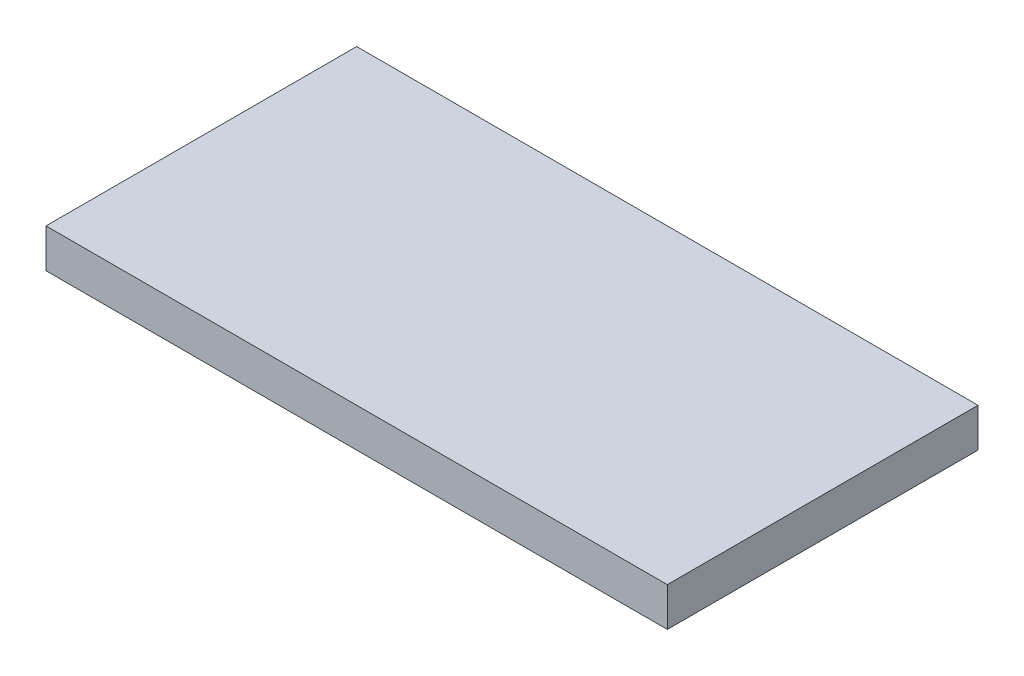
ISO-10303-21;
HEADER;
FILE_DESCRIPTION(('STEP AP214'),'2;1');
FILE_NAME('part.step','',(''),(''),'','','');
FILE_SCHEMA(('AUTOMOTIVE_DESIGN { 1 0 10303 214 1 1 1 1 }'));
ENDSEC;
DATA;
#1=APPLICATION_CONTEXT('core data for automotive mechanical design processes');
#2=APPLICATION_PROTOCOL_DEFINITION('international standard','automotive_design',2000,#1);
#3=PRODUCT_CONTEXT('',#1,'mechanical');
#4=PRODUCT('Part','Part','',(#3));
#5=PRODUCT_RELATED_PRODUCT_CATEGORY('part','',(#4));
#6=PRODUCT_DEFINITION_FORMATION('','',#4);
#7=PRODUCT_DEFINITION_CONTEXT('part definition',#1,'design');
#8=PRODUCT_DEFINITION('design','',#6,#7);
#9=PRODUCT_DEFINITION_SHAPE('','',#8);
#10=(LENGTH_UNIT() NAMED_UNIT(*) SI_UNIT(.MILLI.,.METRE.));
#11=(NAMED_UNIT(*) PLANE_ANGLE_UNIT() SI_UNIT($,.RADIAN.));
#12=(NAMED_UNIT(*) SI_UNIT($,.STERADIAN.) SOLID_ANGLE_UNIT());
#13=UNCERTAINTY_MEASURE_WITH_UNIT(LENGTH_MEASURE(1.E-05),#10,'distance_accuracy_value','');
#14=(GEOMETRIC_REPRESENTATION_CONTEXT(3) GLOBAL_UNCERTAINTY_ASSIGNED_CONTEXT((#13)) GLOBAL_UNIT_ASSIGNED_CONTEXT((#10,
#11,#12)) REPRESENTATION_CONTEXT('',''));
#15=CARTESIAN_POINT('',(0.,0.,0.));
#16=DIRECTION('',(0.,0.,1.));
#17=DIRECTION('',(1.,0.,0.));
#18=AXIS2_PLACEMENT_3D('',#15,#16,#17);
#19=CARTESIAN_POINT('',(-203.2,12.7,-101.6));
#20=DIRECTION('',(1.,0.,0.));
#21=DIRECTION('',(0.,0.,-1.));
#22=AXIS2_PLACEMENT_3D('',#19,#20,#21);
#23=PLANE('',#22);
#24=DIRECTION('',(0.,0.,1.));
#25=VECTOR('',#24,1.);
#26=CARTESIAN_POINT('',(-203.2,-12.7,-101.6));
#27=LINE('',#26,#25);
#28=CARTESIAN_POINT('',(-203.2,-12.7,-101.6));
#29=VERTEX_POINT('',#28);
#30=CARTESIAN_POINT('',(-203.2,-12.7,101.6));
#31=VERTEX_POINT('',#30);
#32=EDGE_CURVE('E95',#29,#31,#27,.T.);
#33=ORIENTED_EDGE('',*,*,#32,.T.);
#34=DIRECTION('',(0.,-1.,0.));
#35=VECTOR('',#34,1.);
#36=CARTESIAN_POINT('',(-203.2,12.7,101.6));
#37=LINE('',#36,#35);
#38=CARTESIAN_POINT('',(-203.2,12.7,101.6));
#39=VERTEX_POINT('',#38);
#40=EDGE_CURVE('E11',#39,#31,#37,.T.);
#41=ORIENTED_EDGE('',*,*,#40,.F.);
#42=DIRECTION('',(0.,0.,1.));
#43=VECTOR('',#42,1.);
#44=CARTESIAN_POINT('',(-203.2,12.7,-101.6));
#45=LINE('',#44,#43);
#46=CARTESIAN_POINT('',(-203.2,12.7,-101.6));
#47=VERTEX_POINT('',#46);
#48=EDGE_CURVE('E83',#47,#39,#45,.T.);
#49=ORIENTED_EDGE('',*,*,#48,.F.);
#50=DIRECTION('',(0.,-1.,0.));
#51=VECTOR('',#50,1.);
#52=CARTESIAN_POINT('',(-203.2,12.7,-101.6));
#53=LINE('',#52,#51);
#54=EDGE_CURVE('E91',#47,#29,#53,.T.);
#55=ORIENTED_EDGE('',*,*,#54,.T.);
#56=EDGE_LOOP('',(#33,#41,#49,#55));
#57=FACE_BOUND('',#56,.T.);
#58=ADVANCED_FACE('F32',(#57),#23,.F.);
#59=CARTESIAN_POINT('',(-203.2,12.7,101.6));
#60=DIRECTION('',(0.,0.,-1.));
#61=DIRECTION('',(-1.,0.,0.));
#62=AXIS2_PLACEMENT_3D('',#59,#60,#61);
#63=PLANE('',#62);
#64=DIRECTION('',(1.,0.,0.));
#65=VECTOR('',#64,1.);
#66=CARTESIAN_POINT('',(-203.2,-12.7,101.6));
#67=LINE('',#66,#65);
#68=CARTESIAN_POINT('',(203.2,-12.7,101.6));
#69=VERTEX_POINT('',#68);
#70=EDGE_CURVE('E87',#31,#69,#67,.T.);
#71=ORIENTED_EDGE('',*,*,#70,.T.);
#72=DIRECTION('',(0.,-1.,0.));
#73=VECTOR('',#72,1.);
#74=CARTESIAN_POINT('',(203.2,12.7,101.6));
#75=LINE('',#74,#73);
#76=CARTESIAN_POINT('',(203.2,12.7,101.6));
#77=VERTEX_POINT('',#76);
#78=EDGE_CURVE('E40',#77,#69,#75,.T.);
#79=ORIENTED_EDGE('',*,*,#78,.F.);
#80=DIRECTION('',(1.,0.,0.));
#81=VECTOR('',#80,1.);
#82=CARTESIAN_POINT('',(-203.2,12.7,101.6));
#83=LINE('',#82,#81);
#84=EDGE_CURVE('E78',#39,#77,#83,.T.);
#85=ORIENTED_EDGE('',*,*,#84,.F.);
#86=ORIENTED_EDGE('',*,*,#40,.T.);
#87=EDGE_LOOP('',(#71,#79,#85,#86));
#88=FACE_BOUND('',#87,.T.);
#89=ADVANCED_FACE('F86',(#88),#63,.F.);
#90=CARTESIAN_POINT('',(203.2,12.7,-101.6));
#91=DIRECTION('',(-1.,0.,0.));
#92=DIRECTION('',(0.,0.,1.));
#93=AXIS2_PLACEMENT_3D('',#90,#91,#92);
#94=PLANE('',#93);
#95=DIRECTION('',(0.,0.,-1.));
#96=VECTOR('',#95,1.);
#97=CARTESIAN_POINT('',(203.2,-12.7,-101.6));
#98=LINE('',#97,#96);
#99=CARTESIAN_POINT('',(203.2,-12.7,-101.6));
#100=VERTEX_POINT('',#99);
#101=EDGE_CURVE('E65',#69,#100,#98,.T.);
#102=ORIENTED_EDGE('',*,*,#101,.T.);
#103=DIRECTION('',(0.,-1.,0.));
#104=VECTOR('',#103,1.);
#105=CARTESIAN_POINT('',(203.2,12.7,-101.6));
#106=LINE('',#105,#104);
#107=CARTESIAN_POINT('',(203.2,12.7,-101.6));
#108=VERTEX_POINT('',#107);
#109=EDGE_CURVE('E88',#108,#100,#106,.T.);
#110=ORIENTED_EDGE('',*,*,#109,.F.);
#111=DIRECTION('',(0.,0.,-1.));
#112=VECTOR('',#111,1.);
#113=CARTESIAN_POINT('',(203.2,12.7,-101.6));
#114=LINE('',#113,#112);
#115=EDGE_CURVE('E81',#77,#108,#114,.T.);
#116=ORIENTED_EDGE('',*,*,#115,.F.);
#117=ORIENTED_EDGE('',*,*,#78,.T.);
#118=EDGE_LOOP('',(#102,#110,#116,#117));
#119=FACE_BOUND('',#118,.T.);
#120=ADVANCED_FACE('F89',(#119),#94,.F.);
#121=CARTESIAN_POINT('',(-203.2,12.7,-101.6));
#122=DIRECTION('',(0.,0.,1.));
#123=DIRECTION('',(1.,0.,0.));
#124=AXIS2_PLACEMENT_3D('',#121,#122,#123);
#125=PLANE('',#124);
#126=DIRECTION('',(-1.,0.,0.));
#127=VECTOR('',#126,1.);
#128=CARTESIAN_POINT('',(-203.2,-12.7,-101.6));
#129=LINE('',#128,#127);
#130=EDGE_CURVE('E71',#100,#29,#129,.T.);
#131=ORIENTED_EDGE('',*,*,#130,.T.);
#132=ORIENTED_EDGE('',*,*,#54,.F.);
#133=DIRECTION('',(-1.,0.,0.));
#134=VECTOR('',#133,1.);
#135=CARTESIAN_POINT('',(-203.2,12.7,-101.6));
#136=LINE('',#135,#134);
#137=EDGE_CURVE('E48',#108,#47,#136,.T.);
#138=ORIENTED_EDGE('',*,*,#137,.F.);
#139=ORIENTED_EDGE('',*,*,#109,.T.);
#140=EDGE_LOOP('',(#131,#132,#138,#139));
#141=FACE_BOUND('',#140,.T.);
#142=ADVANCED_FACE('F102',(#141),#125,.F.);
#143=CARTESIAN_POINT('',(0.,12.7,0.));
#144=DIRECTION('',(0.,1.,0.));
#145=DIRECTION('',(0.,0.,1.));
#146=AXIS2_PLACEMENT_3D('',#143,#144,#145);
#147=PLANE('',#146);
#148=ORIENTED_EDGE('',*,*,#48,.T.);
#149=ORIENTED_EDGE('',*,*,#84,.T.);
#150=ORIENTED_EDGE('',*,*,#115,.T.);
#151=ORIENTED_EDGE('',*,*,#137,.T.);
#152=EDGE_LOOP('',(#148,#149,#150,#151));
#153=FACE_BOUND('',#152,.T.);
#154=ADVANCED_FACE('F79',(#153),#147,.T.);
#155=CARTESIAN_POINT('',(0.,-12.7,0.));
#156=DIRECTION('',(0.,1.,0.));
#157=DIRECTION('',(0.,0.,1.));
#158=AXIS2_PLACEMENT_3D('',#155,#156,#157);
#159=PLANE('',#158);
#160=ORIENTED_EDGE('',*,*,#32,.F.);
#161=ORIENTED_EDGE('',*,*,#130,.F.);
#162=ORIENTED_EDGE('',*,*,#101,.F.);
#163=ORIENTED_EDGE('',*,*,#70,.F.);
#164=EDGE_LOOP('',(#160,#161,#162,#163));
#165=FACE_BOUND('',#164,.T.);
#166=ADVANCED_FACE('F105',(#165),#159,.F.);
#167=CLOSED_SHELL('',(#58,#89,#120,#142,#154,#166));
#168=MANIFOLD_SOLID_BREP('B2',#167);
#169=ADVANCED_BREP_SHAPE_REPRESENTATION('',(#18,#168),#14);
#170=SHAPE_DEFINITION_REPRESENTATION(#9,#169);
ENDSEC;
END-ISO-10303-21;
